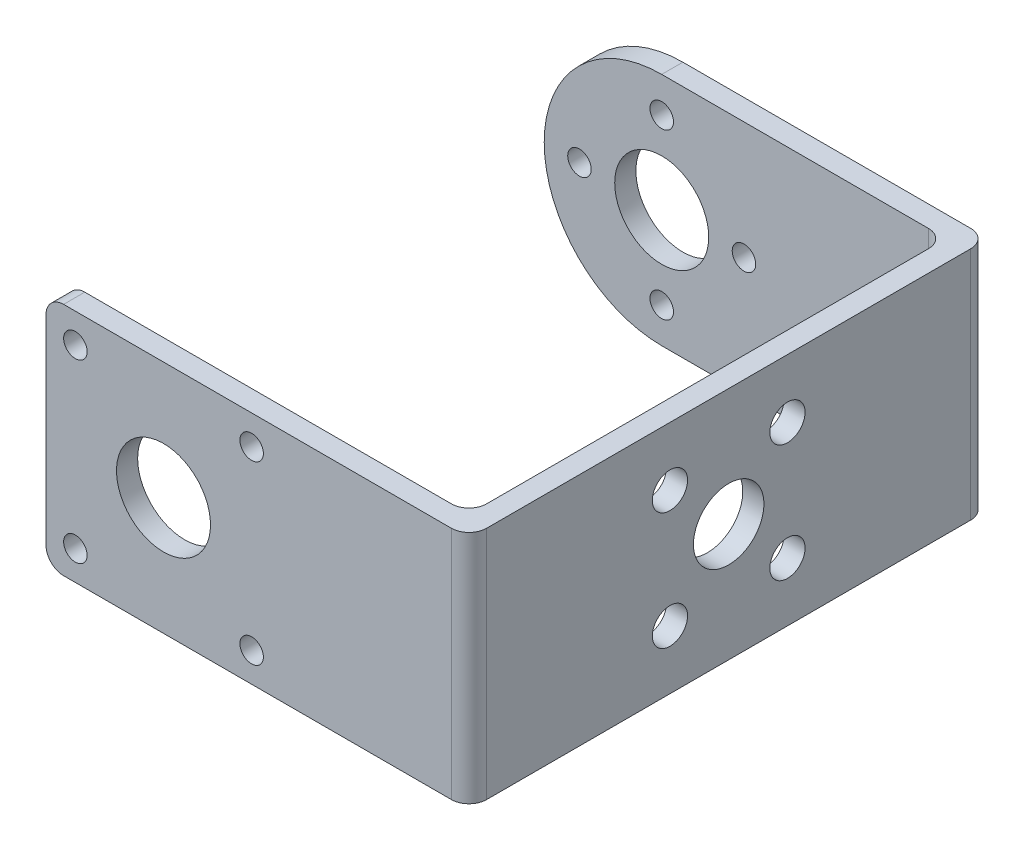
ISO-10303-21;
HEADER;
FILE_DESCRIPTION(('STEP AP214'),'2;1');
FILE_NAME('part.step','',(''),(''),'','','');
FILE_SCHEMA(('AUTOMOTIVE_DESIGN { 1 0 10303 214 1 1 1 1 }'));
ENDSEC;
DATA;
#1=APPLICATION_CONTEXT('core data for automotive mechanical design processes');
#2=APPLICATION_PROTOCOL_DEFINITION('international standard','automotive_design',2000,#1);
#3=PRODUCT_CONTEXT('',#1,'mechanical');
#4=PRODUCT('Part','Part','',(#3));
#5=PRODUCT_RELATED_PRODUCT_CATEGORY('part','',(#4));
#6=PRODUCT_DEFINITION_FORMATION('','',#4);
#7=PRODUCT_DEFINITION_CONTEXT('part definition',#1,'design');
#8=PRODUCT_DEFINITION('design','',#6,#7);
#9=PRODUCT_DEFINITION_SHAPE('','',#8);
#10=(LENGTH_UNIT() NAMED_UNIT(*) SI_UNIT(.MILLI.,.METRE.));
#11=(NAMED_UNIT(*) PLANE_ANGLE_UNIT() SI_UNIT($,.RADIAN.));
#12=(NAMED_UNIT(*) SI_UNIT($,.STERADIAN.) SOLID_ANGLE_UNIT());
#13=UNCERTAINTY_MEASURE_WITH_UNIT(LENGTH_MEASURE(1.E-05),#10,'distance_accuracy_value','');
#14=(GEOMETRIC_REPRESENTATION_CONTEXT(3) GLOBAL_UNCERTAINTY_ASSIGNED_CONTEXT((#13)) GLOBAL_UNIT_ASSIGNED_CONTEXT((#10,
#11,#12)) REPRESENTATION_CONTEXT('',''));
#15=CARTESIAN_POINT('',(0.,0.,0.));
#16=DIRECTION('',(0.,0.,1.));
#17=DIRECTION('',(1.,0.,0.));
#18=AXIS2_PLACEMENT_3D('',#15,#16,#17);
#19=CARTESIAN_POINT('',(-18.,10.,-20.3));
#20=DIRECTION('',(0.,0.,-1.));
#21=DIRECTION('',(-1.,0.,0.));
#22=AXIS2_PLACEMENT_3D('',#19,#20,#21);
#23=PLANE('',#22);
#24=CARTESIAN_POINT('',(-7.99999999999999,-7.,-20.3));
#25=DIRECTION('',(0.,0.,-1.));
#26=DIRECTION('',(-1.,0.,0.));
#27=AXIS2_PLACEMENT_3D('',#24,#25,#26);
#28=CIRCLE('',#27,1.);
#29=CARTESIAN_POINT('',(-8.99999999999999,-7.,-20.3));
#30=VERTEX_POINT('',#29);
#31=EDGE_CURVE('E422',#30,#30,#28,.T.);
#32=ORIENTED_EDGE('',*,*,#31,.T.);
#33=EDGE_LOOP('',(#32));
#34=FACE_BOUND('',#33,.T.);
#35=CARTESIAN_POINT('',(-15.,0.,-20.3));
#36=DIRECTION('',(0.,0.,-1.));
#37=DIRECTION('',(-1.,0.,0.));
#38=AXIS2_PLACEMENT_3D('',#35,#36,#37);
#39=CIRCLE('',#38,1.);
#40=CARTESIAN_POINT('',(-16.,0.,-20.3));
#41=VERTEX_POINT('',#40);
#42=EDGE_CURVE('E424',#41,#41,#39,.T.);
#43=ORIENTED_EDGE('',*,*,#42,.T.);
#44=EDGE_LOOP('',(#43));
#45=FACE_BOUND('',#44,.T.);
#46=CARTESIAN_POINT('',(-7.99999999999994,7.,-20.3));
#47=DIRECTION('',(0.,0.,-1.));
#48=DIRECTION('',(-1.,0.,0.));
#49=AXIS2_PLACEMENT_3D('',#46,#47,#48);
#50=CIRCLE('',#49,1.);
#51=CARTESIAN_POINT('',(-8.99999999999994,7.,-20.3));
#52=VERTEX_POINT('',#51);
#53=EDGE_CURVE('E430',#52,#52,#50,.T.);
#54=ORIENTED_EDGE('',*,*,#53,.T.);
#55=EDGE_LOOP('',(#54));
#56=FACE_BOUND('',#55,.T.);
#57=CARTESIAN_POINT('',(-0.999999999999994,0.,-20.3));
#58=DIRECTION('',(0.,0.,-1.));
#59=DIRECTION('',(-1.,0.,0.));
#60=AXIS2_PLACEMENT_3D('',#57,#58,#59);
#61=CIRCLE('',#60,1.);
#62=CARTESIAN_POINT('',(-1.99999999999999,0.,-20.3));
#63=VERTEX_POINT('',#62);
#64=EDGE_CURVE('E509',#63,#63,#61,.T.);
#65=ORIENTED_EDGE('',*,*,#64,.T.);
#66=EDGE_LOOP('',(#65));
#67=FACE_BOUND('',#66,.T.);
#68=CARTESIAN_POINT('',(-7.99999999999999,0.,-20.3));
#69=DIRECTION('',(0.,0.,-1.));
#70=DIRECTION('',(-1.,0.,0.));
#71=AXIS2_PLACEMENT_3D('',#68,#69,#70);
#72=CIRCLE('',#71,4.);
#73=CARTESIAN_POINT('',(-12.,0.,-20.3));
#74=VERTEX_POINT('',#73);
#75=EDGE_CURVE('E139',#74,#74,#72,.T.);
#76=ORIENTED_EDGE('',*,*,#75,.T.);
#77=EDGE_LOOP('',(#76));
#78=FACE_BOUND('',#77,.T.);
#79=CARTESIAN_POINT('',(-8.,0.,-20.3));
#80=DIRECTION('',(0.,0.,-1.));
#81=DIRECTION('',(-1.,0.,0.));
#82=AXIS2_PLACEMENT_3D('',#79,#80,#81);
#83=CIRCLE('',#82,10.);
#84=CARTESIAN_POINT('',(-8.,-10.,-20.3));
#85=VERTEX_POINT('',#84);
#86=CARTESIAN_POINT('',(-8.,10.,-20.3));
#87=VERTEX_POINT('',#86);
#88=EDGE_CURVE('E50',#85,#87,#83,.T.);
#89=ORIENTED_EDGE('',*,*,#88,.F.);
#90=DIRECTION('',(1.,0.,0.));
#91=VECTOR('',#90,1.);
#92=CARTESIAN_POINT('',(-18.,-10.,-20.3));
#93=LINE('',#92,#91);
#94=CARTESIAN_POINT('',(14.7,-10.,-20.3));
#95=VERTEX_POINT('',#94);
#96=EDGE_CURVE('E146',#85,#95,#93,.T.);
#97=ORIENTED_EDGE('',*,*,#96,.T.);
#98=DIRECTION('',(0.,-1.,0.));
#99=VECTOR('',#98,1.);
#100=CARTESIAN_POINT('',(14.7,10.,-20.3));
#101=LINE('',#100,#99);
#102=CARTESIAN_POINT('',(14.7,10.,-20.3));
#103=VERTEX_POINT('',#102);
#104=EDGE_CURVE('E208',#95,#103,#101,.F.);
#105=ORIENTED_EDGE('',*,*,#104,.T.);
#106=DIRECTION('',(1.,0.,0.));
#107=VECTOR('',#106,1.);
#108=CARTESIAN_POINT('',(-18.,10.,-20.3));
#109=LINE('',#108,#107);
#110=EDGE_CURVE('E150',#87,#103,#109,.T.);
#111=ORIENTED_EDGE('',*,*,#110,.F.);
#112=EDGE_LOOP('',(#89,#97,#105,#111));
#113=FACE_BOUND('',#112,.T.);
#114=ADVANCED_FACE('F33',(#34,#45,#56,#67,#78,#113),#23,.F.);
#115=CARTESIAN_POINT('',(-18.,10.,-22.1));
#116=DIRECTION('',(0.,0.,-1.));
#117=DIRECTION('',(-1.,0.,0.));
#118=AXIS2_PLACEMENT_3D('',#115,#116,#117);
#119=PLANE('',#118);
#120=CARTESIAN_POINT('',(-7.99999999999999,-7.,-22.1));
#121=DIRECTION('',(0.,0.,-1.));
#122=DIRECTION('',(-1.,0.,0.));
#123=AXIS2_PLACEMENT_3D('',#120,#121,#122);
#124=CIRCLE('',#123,1.);
#125=CARTESIAN_POINT('',(-8.99999999999999,-7.,-22.1));
#126=VERTEX_POINT('',#125);
#127=EDGE_CURVE('E420',#126,#126,#124,.T.);
#128=ORIENTED_EDGE('',*,*,#127,.F.);
#129=EDGE_LOOP('',(#128));
#130=FACE_BOUND('',#129,.T.);
#131=CARTESIAN_POINT('',(-15.,0.,-22.1));
#132=DIRECTION('',(0.,0.,-1.));
#133=DIRECTION('',(-1.,0.,0.));
#134=AXIS2_PLACEMENT_3D('',#131,#132,#133);
#135=CIRCLE('',#134,1.);
#136=CARTESIAN_POINT('',(-16.,0.,-22.1));
#137=VERTEX_POINT('',#136);
#138=EDGE_CURVE('E518',#137,#137,#135,.T.);
#139=ORIENTED_EDGE('',*,*,#138,.F.);
#140=EDGE_LOOP('',(#139));
#141=FACE_BOUND('',#140,.T.);
#142=CARTESIAN_POINT('',(-7.99999999999994,7.,-22.1));
#143=DIRECTION('',(0.,0.,-1.));
#144=DIRECTION('',(-1.,0.,0.));
#145=AXIS2_PLACEMENT_3D('',#142,#143,#144);
#146=CIRCLE('',#145,1.);
#147=CARTESIAN_POINT('',(-8.99999999999994,7.,-22.1));
#148=VERTEX_POINT('',#147);
#149=EDGE_CURVE('E515',#148,#148,#146,.T.);
#150=ORIENTED_EDGE('',*,*,#149,.F.);
#151=EDGE_LOOP('',(#150));
#152=FACE_BOUND('',#151,.T.);
#153=CARTESIAN_POINT('',(-0.999999999999994,0.,-22.1));
#154=DIRECTION('',(0.,0.,-1.));
#155=DIRECTION('',(-1.,0.,0.));
#156=AXIS2_PLACEMENT_3D('',#153,#154,#155);
#157=CIRCLE('',#156,1.);
#158=CARTESIAN_POINT('',(-1.99999999999999,0.,-22.1));
#159=VERTEX_POINT('',#158);
#160=EDGE_CURVE('E512',#159,#159,#157,.T.);
#161=ORIENTED_EDGE('',*,*,#160,.F.);
#162=EDGE_LOOP('',(#161));
#163=FACE_BOUND('',#162,.T.);
#164=CARTESIAN_POINT('',(-7.99999999999999,0.,-22.1));
#165=DIRECTION('',(0.,0.,1.));
#166=DIRECTION('',(1.,0.,0.));
#167=AXIS2_PLACEMENT_3D('',#164,#165,#166);
#168=CIRCLE('',#167,4.);
#169=CARTESIAN_POINT('',(-3.99999999999999,0.,-22.1));
#170=VERTEX_POINT('',#169);
#171=EDGE_CURVE('E238',#170,#170,#168,.T.);
#172=ORIENTED_EDGE('',*,*,#171,.T.);
#173=EDGE_LOOP('',(#172));
#174=FACE_BOUND('',#173,.T.);
#175=DIRECTION('',(1.,0.,0.));
#176=VECTOR('',#175,1.);
#177=CARTESIAN_POINT('',(-18.,-10.,-22.1));
#178=LINE('',#177,#176);
#179=CARTESIAN_POINT('',(-8.,-10.,-22.1));
#180=VERTEX_POINT('',#179);
#181=CARTESIAN_POINT('',(16.5,-10.,-22.1));
#182=VERTEX_POINT('',#181);
#183=EDGE_CURVE('E143',#180,#182,#178,.T.);
#184=ORIENTED_EDGE('',*,*,#183,.F.);
#185=CARTESIAN_POINT('',(-8.,0.,-22.1));
#186=DIRECTION('',(0.,0.,-1.));
#187=DIRECTION('',(-1.,0.,0.));
#188=AXIS2_PLACEMENT_3D('',#185,#186,#187);
#189=CIRCLE('',#188,10.);
#190=CARTESIAN_POINT('',(-8.,10.,-22.1));
#191=VERTEX_POINT('',#190);
#192=EDGE_CURVE('E135',#180,#191,#189,.T.);
#193=ORIENTED_EDGE('',*,*,#192,.T.);
#194=DIRECTION('',(1.,0.,0.));
#195=VECTOR('',#194,1.);
#196=CARTESIAN_POINT('',(-18.,10.,-22.1));
#197=LINE('',#196,#195);
#198=CARTESIAN_POINT('',(16.5,10.,-22.1));
#199=VERTEX_POINT('',#198);
#200=EDGE_CURVE('E58',#191,#199,#197,.T.);
#201=ORIENTED_EDGE('',*,*,#200,.T.);
#202=DIRECTION('',(0.,-1.,0.));
#203=VECTOR('',#202,1.);
#204=CARTESIAN_POINT('',(16.5,-10.,-22.1));
#205=LINE('',#204,#203);
#206=EDGE_CURVE('E149',#199,#182,#205,.T.);
#207=ORIENTED_EDGE('',*,*,#206,.T.);
#208=EDGE_LOOP('',(#184,#193,#201,#207));
#209=FACE_BOUND('',#208,.T.);
#210=ADVANCED_FACE('F147',(#130,#141,#152,#163,#174,#209),#119,.T.);
#211=CARTESIAN_POINT('',(16.2,10.,20.3));
#212=DIRECTION('',(-1.,0.,0.));
#213=DIRECTION('',(0.,0.,1.));
#214=AXIS2_PLACEMENT_3D('',#211,#212,#213);
#215=PLANE('',#214);
#216=CARTESIAN_POINT('',(16.2,4.99999999999995,5.00000000000005));
#217=DIRECTION('',(-1.,0.,0.));
#218=DIRECTION('',(0.,0.,1.));
#219=AXIS2_PLACEMENT_3D('',#216,#217,#218);
#220=CIRCLE('',#219,1.5);
#221=CARTESIAN_POINT('',(16.2,4.99999999999995,6.50000000000005));
#222=VERTEX_POINT('',#221);
#223=EDGE_CURVE('E454',#222,#222,#220,.T.);
#224=ORIENTED_EDGE('',*,*,#223,.F.);
#225=EDGE_LOOP('',(#224));
#226=FACE_BOUND('',#225,.T.);
#227=CARTESIAN_POINT('',(16.2,5.00000000000003,-4.99999999999996));
#228=DIRECTION('',(-1.,0.,0.));
#229=DIRECTION('',(0.,0.,1.));
#230=AXIS2_PLACEMENT_3D('',#227,#228,#229);
#231=CIRCLE('',#230,1.5);
#232=CARTESIAN_POINT('',(16.2,5.00000000000003,-3.49999999999996));
#233=VERTEX_POINT('',#232);
#234=EDGE_CURVE('E461',#233,#233,#231,.T.);
#235=ORIENTED_EDGE('',*,*,#234,.F.);
#236=EDGE_LOOP('',(#235));
#237=FACE_BOUND('',#236,.T.);
#238=CARTESIAN_POINT('',(16.2,-4.99999999999998,-5.00000000000002));
#239=DIRECTION('',(-1.,0.,0.));
#240=DIRECTION('',(0.,0.,1.));
#241=AXIS2_PLACEMENT_3D('',#238,#239,#240);
#242=CIRCLE('',#241,1.5);
#243=CARTESIAN_POINT('',(16.2,-4.99999999999998,-3.50000000000002));
#244=VERTEX_POINT('',#243);
#245=EDGE_CURVE('E458',#244,#244,#242,.T.);
#246=ORIENTED_EDGE('',*,*,#245,.F.);
#247=EDGE_LOOP('',(#246));
#248=FACE_BOUND('',#247,.T.);
#249=CARTESIAN_POINT('',(16.2,-5.,5.));
#250=DIRECTION('',(-1.,0.,0.));
#251=DIRECTION('',(0.,0.,1.));
#252=AXIS2_PLACEMENT_3D('',#249,#250,#251);
#253=CIRCLE('',#252,1.5);
#254=CARTESIAN_POINT('',(16.2,-5.,6.5));
#255=VERTEX_POINT('',#254);
#256=EDGE_CURVE('E455',#255,#255,#253,.T.);
#257=ORIENTED_EDGE('',*,*,#256,.F.);
#258=EDGE_LOOP('',(#257));
#259=FACE_BOUND('',#258,.T.);
#260=CARTESIAN_POINT('',(16.2,0.,0.));
#261=DIRECTION('',(-1.,0.,0.));
#262=DIRECTION('',(0.,0.,1.));
#263=AXIS2_PLACEMENT_3D('',#260,#261,#262);
#264=CIRCLE('',#263,3.);
#265=CARTESIAN_POINT('',(16.2,0.,3.));
#266=VERTEX_POINT('',#265);
#267=EDGE_CURVE('E224',#266,#266,#264,.T.);
#268=ORIENTED_EDGE('',*,*,#267,.F.);
#269=EDGE_LOOP('',(#268));
#270=FACE_BOUND('',#269,.T.);
#271=DIRECTION('',(0.,0.,-1.));
#272=VECTOR('',#271,1.);
#273=CARTESIAN_POINT('',(16.2,-10.,20.3));
#274=LINE('',#273,#272);
#275=CARTESIAN_POINT('',(16.2,-10.,18.8));
#276=VERTEX_POINT('',#275);
#277=CARTESIAN_POINT('',(16.2,-10.,-18.8));
#278=VERTEX_POINT('',#277);
#279=EDGE_CURVE('E265',#276,#278,#274,.T.);
#280=ORIENTED_EDGE('',*,*,#279,.F.);
#281=DIRECTION('',(0.,-1.,0.));
#282=VECTOR('',#281,1.);
#283=CARTESIAN_POINT('',(16.2,10.,18.8));
#284=LINE('',#283,#282);
#285=CARTESIAN_POINT('',(16.2,10.,18.8));
#286=VERTEX_POINT('',#285);
#287=EDGE_CURVE('E206',#276,#286,#284,.F.);
#288=ORIENTED_EDGE('',*,*,#287,.T.);
#289=DIRECTION('',(0.,0.,-1.));
#290=VECTOR('',#289,1.);
#291=CARTESIAN_POINT('',(16.2,10.,20.3));
#292=LINE('',#291,#290);
#293=CARTESIAN_POINT('',(16.2,10.,-18.8));
#294=VERTEX_POINT('',#293);
#295=EDGE_CURVE('E153',#286,#294,#292,.T.);
#296=ORIENTED_EDGE('',*,*,#295,.T.);
#297=DIRECTION('',(0.,-1.,0.));
#298=VECTOR('',#297,1.);
#299=CARTESIAN_POINT('',(16.2,10.,-18.8));
#300=LINE('',#299,#298);
#301=EDGE_CURVE('E203',#294,#278,#300,.T.);
#302=ORIENTED_EDGE('',*,*,#301,.T.);
#303=EDGE_LOOP('',(#280,#288,#296,#302));
#304=FACE_BOUND('',#303,.T.);
#305=ADVANCED_FACE('F301',(#226,#237,#248,#259,#270,#304),#215,.T.);
#306=CARTESIAN_POINT('',(-18.,10.,20.3));
#307=DIRECTION('',(0.,0.,-1.));
#308=DIRECTION('',(-1.,0.,0.));
#309=AXIS2_PLACEMENT_3D('',#306,#307,#308);
#310=PLANE('',#309);
#311=CARTESIAN_POINT('',(-0.50000000000007,-7.50000000000008,20.3));
#312=DIRECTION('',(0.,0.,-1.));
#313=DIRECTION('',(-1.,0.,0.));
#314=AXIS2_PLACEMENT_3D('',#311,#312,#313);
#315=CIRCLE('',#314,1.);
#316=CARTESIAN_POINT('',(-1.50000000000007,-7.50000000000008,20.3));
#317=VERTEX_POINT('',#316);
#318=EDGE_CURVE('E451',#317,#317,#315,.T.);
#319=ORIENTED_EDGE('',*,*,#318,.F.);
#320=EDGE_LOOP('',(#319));
#321=FACE_BOUND('',#320,.T.);
#322=CARTESIAN_POINT('',(-0.499999999999937,7.49999999999994,20.3));
#323=DIRECTION('',(0.,0.,-1.));
#324=DIRECTION('',(-1.,0.,0.));
#325=AXIS2_PLACEMENT_3D('',#322,#323,#324);
#326=CIRCLE('',#325,1.);
#327=CARTESIAN_POINT('',(-1.49999999999994,7.49999999999994,20.3));
#328=VERTEX_POINT('',#327);
#329=EDGE_CURVE('E448',#328,#328,#326,.T.);
#330=ORIENTED_EDGE('',*,*,#329,.F.);
#331=EDGE_LOOP('',(#330));
#332=FACE_BOUND('',#331,.T.);
#333=CARTESIAN_POINT('',(-15.5,7.50000000000003,20.3));
#334=DIRECTION('',(0.,0.,-1.));
#335=DIRECTION('',(-1.,0.,0.));
#336=AXIS2_PLACEMENT_3D('',#333,#334,#335);
#337=CIRCLE('',#336,1.);
#338=CARTESIAN_POINT('',(-16.5,7.50000000000003,20.3));
#339=VERTEX_POINT('',#338);
#340=EDGE_CURVE('E445',#339,#339,#337,.T.);
#341=ORIENTED_EDGE('',*,*,#340,.F.);
#342=EDGE_LOOP('',(#341));
#343=FACE_BOUND('',#342,.T.);
#344=CARTESIAN_POINT('',(-15.5,-7.5,20.3));
#345=DIRECTION('',(0.,0.,-1.));
#346=DIRECTION('',(-1.,0.,0.));
#347=AXIS2_PLACEMENT_3D('',#344,#345,#346);
#348=CIRCLE('',#347,1.);
#349=CARTESIAN_POINT('',(-16.5,-7.5,20.3));
#350=VERTEX_POINT('',#349);
#351=EDGE_CURVE('E442',#350,#350,#348,.T.);
#352=ORIENTED_EDGE('',*,*,#351,.F.);
#353=EDGE_LOOP('',(#352));
#354=FACE_BOUND('',#353,.T.);
#355=CARTESIAN_POINT('',(-7.99999999999999,0.,20.3));
#356=DIRECTION('',(0.,0.,-1.));
#357=DIRECTION('',(-1.,0.,0.));
#358=AXIS2_PLACEMENT_3D('',#355,#356,#357);
#359=CIRCLE('',#358,4.);
#360=CARTESIAN_POINT('',(-12.,0.,20.3));
#361=VERTEX_POINT('',#360);
#362=EDGE_CURVE('E243',#361,#361,#359,.T.);
#363=ORIENTED_EDGE('',*,*,#362,.F.);
#364=EDGE_LOOP('',(#363));
#365=FACE_BOUND('',#364,.T.);
#366=DIRECTION('',(1.,0.,0.));
#367=VECTOR('',#366,1.);
#368=CARTESIAN_POINT('',(-18.,-10.,20.3));
#369=LINE('',#368,#367);
#370=CARTESIAN_POINT('',(-16.5,-10.,20.3));
#371=VERTEX_POINT('',#370);
#372=CARTESIAN_POINT('',(14.7,-10.,20.3));
#373=VERTEX_POINT('',#372);
#374=EDGE_CURVE('E268',#371,#373,#369,.T.);
#375=ORIENTED_EDGE('',*,*,#374,.F.);
#376=CARTESIAN_POINT('',(-16.5,-8.5,20.3));
#377=DIRECTION('',(0.,0.,-1.));
#378=DIRECTION('',(-1.,0.,0.));
#379=AXIS2_PLACEMENT_3D('',#376,#377,#378);
#380=CIRCLE('',#379,1.5);
#381=CARTESIAN_POINT('',(-18.,-8.5,20.3));
#382=VERTEX_POINT('',#381);
#383=EDGE_CURVE('E188',#371,#382,#380,.T.);
#384=ORIENTED_EDGE('',*,*,#383,.T.);
#385=DIRECTION('',(0.,-1.,0.));
#386=VECTOR('',#385,1.);
#387=CARTESIAN_POINT('',(-18.,10.,20.3));
#388=LINE('',#387,#386);
#389=CARTESIAN_POINT('',(-18.,8.5,20.3));
#390=VERTEX_POINT('',#389);
#391=EDGE_CURVE('E163',#390,#382,#388,.T.);
#392=ORIENTED_EDGE('',*,*,#391,.F.);
#393=CARTESIAN_POINT('',(-16.5,8.5,20.3));
#394=DIRECTION('',(0.,0.,-1.));
#395=DIRECTION('',(-1.,0.,0.));
#396=AXIS2_PLACEMENT_3D('',#393,#394,#395);
#397=CIRCLE('',#396,1.5);
#398=CARTESIAN_POINT('',(-16.5,10.,20.3));
#399=VERTEX_POINT('',#398);
#400=EDGE_CURVE('E186',#390,#399,#397,.T.);
#401=ORIENTED_EDGE('',*,*,#400,.T.);
#402=DIRECTION('',(1.,0.,0.));
#403=VECTOR('',#402,1.);
#404=CARTESIAN_POINT('',(-18.,10.,20.3));
#405=LINE('',#404,#403);
#406=CARTESIAN_POINT('',(14.7,10.,20.3));
#407=VERTEX_POINT('',#406);
#408=EDGE_CURVE('E254',#399,#407,#405,.T.);
#409=ORIENTED_EDGE('',*,*,#408,.T.);
#410=DIRECTION('',(0.,-1.,0.));
#411=VECTOR('',#410,1.);
#412=CARTESIAN_POINT('',(14.7,-10.,20.3));
#413=LINE('',#412,#411);
#414=EDGE_CURVE('E183',#407,#373,#413,.T.);
#415=ORIENTED_EDGE('',*,*,#414,.T.);
#416=EDGE_LOOP('',(#375,#384,#392,#401,#409,#415));
#417=FACE_BOUND('',#416,.T.);
#418=ADVANCED_FACE('F310',(#321,#332,#343,#354,#365,#417),#310,.T.);
#419=CARTESIAN_POINT('',(-18.,10.,20.3));
#420=DIRECTION('',(1.,0.,0.));
#421=DIRECTION('',(0.,0.,-1.));
#422=AXIS2_PLACEMENT_3D('',#419,#420,#421);
#423=PLANE('',#422);
#424=ORIENTED_EDGE('',*,*,#391,.T.);
#425=DIRECTION('',(0.,0.,1.));
#426=VECTOR('',#425,1.);
#427=CARTESIAN_POINT('',(-18.,-8.5,20.3));
#428=LINE('',#427,#426);
#429=CARTESIAN_POINT('',(-18.,-8.5,22.1));
#430=VERTEX_POINT('',#429);
#431=EDGE_CURVE('E168',#382,#430,#428,.T.);
#432=ORIENTED_EDGE('',*,*,#431,.T.);
#433=DIRECTION('',(0.,-1.,0.));
#434=VECTOR('',#433,1.);
#435=CARTESIAN_POINT('',(-18.,10.,22.1));
#436=LINE('',#435,#434);
#437=CARTESIAN_POINT('',(-18.,8.5,22.1));
#438=VERTEX_POINT('',#437);
#439=EDGE_CURVE('E160',#438,#430,#436,.T.);
#440=ORIENTED_EDGE('',*,*,#439,.F.);
#441=DIRECTION('',(0.,0.,1.));
#442=VECTOR('',#441,1.);
#443=CARTESIAN_POINT('',(-18.,8.5,20.3));
#444=LINE('',#443,#442);
#445=EDGE_CURVE('E166',#438,#390,#444,.F.);
#446=ORIENTED_EDGE('',*,*,#445,.T.);
#447=EDGE_LOOP('',(#424,#432,#440,#446));
#448=FACE_BOUND('',#447,.T.);
#449=ADVANCED_FACE('F318',(#448),#423,.F.);
#450=CARTESIAN_POINT('',(-18.,10.,22.1));
#451=DIRECTION('',(0.,0.,-1.));
#452=DIRECTION('',(-1.,0.,0.));
#453=AXIS2_PLACEMENT_3D('',#450,#451,#452);
#454=PLANE('',#453);
#455=CARTESIAN_POINT('',(-0.50000000000007,-7.50000000000008,22.1));
#456=DIRECTION('',(0.,0.,1.));
#457=DIRECTION('',(1.,0.,0.));
#458=AXIS2_PLACEMENT_3D('',#455,#456,#457);
#459=CIRCLE('',#458,1.);
#460=CARTESIAN_POINT('',(0.49999999999993,-7.50000000000008,22.1));
#461=VERTEX_POINT('',#460);
#462=EDGE_CURVE('E423',#461,#461,#459,.T.);
#463=ORIENTED_EDGE('',*,*,#462,.F.);
#464=EDGE_LOOP('',(#463));
#465=FACE_BOUND('',#464,.T.);
#466=CARTESIAN_POINT('',(-0.499999999999937,7.49999999999994,22.1));
#467=DIRECTION('',(0.,0.,1.));
#468=DIRECTION('',(1.,0.,0.));
#469=AXIS2_PLACEMENT_3D('',#466,#467,#468);
#470=CIRCLE('',#469,1.);
#471=CARTESIAN_POINT('',(0.500000000000064,7.49999999999994,22.1));
#472=VERTEX_POINT('',#471);
#473=EDGE_CURVE('E427',#472,#472,#470,.T.);
#474=ORIENTED_EDGE('',*,*,#473,.F.);
#475=EDGE_LOOP('',(#474));
#476=FACE_BOUND('',#475,.T.);
#477=CARTESIAN_POINT('',(-15.5,7.50000000000003,22.1));
#478=DIRECTION('',(0.,0.,1.));
#479=DIRECTION('',(1.,0.,0.));
#480=AXIS2_PLACEMENT_3D('',#477,#478,#479);
#481=CIRCLE('',#480,1.);
#482=CARTESIAN_POINT('',(-14.5,7.50000000000003,22.1));
#483=VERTEX_POINT('',#482);
#484=EDGE_CURVE('E434',#483,#483,#481,.T.);
#485=ORIENTED_EDGE('',*,*,#484,.F.);
#486=EDGE_LOOP('',(#485));
#487=FACE_BOUND('',#486,.T.);
#488=CARTESIAN_POINT('',(-15.5,-7.5,22.1));
#489=DIRECTION('',(0.,0.,1.));
#490=DIRECTION('',(1.,0.,0.));
#491=AXIS2_PLACEMENT_3D('',#488,#489,#490);
#492=CIRCLE('',#491,1.);
#493=CARTESIAN_POINT('',(-14.5,-7.5,22.1));
#494=VERTEX_POINT('',#493);
#495=EDGE_CURVE('E437',#494,#494,#492,.T.);
#496=ORIENTED_EDGE('',*,*,#495,.F.);
#497=EDGE_LOOP('',(#496));
#498=FACE_BOUND('',#497,.T.);
#499=CARTESIAN_POINT('',(-7.99999999999999,0.,22.1));
#500=DIRECTION('',(0.,0.,1.));
#501=DIRECTION('',(1.,0.,0.));
#502=AXIS2_PLACEMENT_3D('',#499,#500,#501);
#503=CIRCLE('',#502,4.);
#504=CARTESIAN_POINT('',(-3.99999999999999,0.,22.1));
#505=VERTEX_POINT('',#504);
#506=EDGE_CURVE('E234',#505,#505,#503,.T.);
#507=ORIENTED_EDGE('',*,*,#506,.F.);
#508=EDGE_LOOP('',(#507));
#509=FACE_BOUND('',#508,.T.);
#510=ORIENTED_EDGE('',*,*,#439,.T.);
#511=CARTESIAN_POINT('',(-16.5,-8.5,22.1));
#512=DIRECTION('',(0.,0.,-1.));
#513=DIRECTION('',(-1.,0.,0.));
#514=AXIS2_PLACEMENT_3D('',#511,#512,#513);
#515=CIRCLE('',#514,1.5);
#516=CARTESIAN_POINT('',(-16.5,-10.,22.1));
#517=VERTEX_POINT('',#516);
#518=EDGE_CURVE('E175',#430,#517,#515,.F.);
#519=ORIENTED_EDGE('',*,*,#518,.T.);
#520=DIRECTION('',(1.,0.,0.));
#521=VECTOR('',#520,1.);
#522=CARTESIAN_POINT('',(-18.,-10.,22.1));
#523=LINE('',#522,#521);
#524=CARTESIAN_POINT('',(16.5,-10.,22.1));
#525=VERTEX_POINT('',#524);
#526=EDGE_CURVE('E156',#517,#525,#523,.T.);
#527=ORIENTED_EDGE('',*,*,#526,.T.);
#528=DIRECTION('',(0.,-1.,0.));
#529=VECTOR('',#528,1.);
#530=CARTESIAN_POINT('',(16.5,10.,22.1));
#531=LINE('',#530,#529);
#532=CARTESIAN_POINT('',(16.5,10.,22.1));
#533=VERTEX_POINT('',#532);
#534=EDGE_CURVE('E171',#525,#533,#531,.F.);
#535=ORIENTED_EDGE('',*,*,#534,.T.);
#536=DIRECTION('',(1.,0.,0.));
#537=VECTOR('',#536,1.);
#538=CARTESIAN_POINT('',(-18.,10.,22.1));
#539=LINE('',#538,#537);
#540=CARTESIAN_POINT('',(-16.5,10.,22.1));
#541=VERTEX_POINT('',#540);
#542=EDGE_CURVE('E257',#541,#533,#539,.T.);
#543=ORIENTED_EDGE('',*,*,#542,.F.);
#544=CARTESIAN_POINT('',(-16.5,8.5,22.1));
#545=DIRECTION('',(0.,0.,-1.));
#546=DIRECTION('',(-1.,0.,0.));
#547=AXIS2_PLACEMENT_3D('',#544,#545,#546);
#548=CIRCLE('',#547,1.5);
#549=EDGE_CURVE('E173',#541,#438,#548,.F.);
#550=ORIENTED_EDGE('',*,*,#549,.T.);
#551=EDGE_LOOP('',(#510,#519,#527,#535,#543,#550));
#552=FACE_BOUND('',#551,.T.);
#553=ADVANCED_FACE('F274',(#465,#476,#487,#498,#509,#552),#454,.F.);
#554=CARTESIAN_POINT('',(18.,10.,22.1));
#555=DIRECTION('',(-1.,0.,0.));
#556=DIRECTION('',(0.,0.,1.));
#557=AXIS2_PLACEMENT_3D('',#554,#555,#556);
#558=PLANE('',#557);
#559=CARTESIAN_POINT('',(18.,4.99999999999995,5.00000000000005));
#560=DIRECTION('',(-1.,0.,0.));
#561=DIRECTION('',(0.,0.,1.));
#562=AXIS2_PLACEMENT_3D('',#559,#560,#561);
#563=CIRCLE('',#562,1.5);
#564=CARTESIAN_POINT('',(18.,4.99999999999995,6.50000000000005));
#565=VERTEX_POINT('',#564);
#566=EDGE_CURVE('E37',#565,#565,#563,.T.);
#567=ORIENTED_EDGE('',*,*,#566,.T.);
#568=EDGE_LOOP('',(#567));
#569=FACE_BOUND('',#568,.T.);
#570=CARTESIAN_POINT('',(18.,5.00000000000003,-4.99999999999996));
#571=DIRECTION('',(-1.,0.,0.));
#572=DIRECTION('',(0.,0.,1.));
#573=AXIS2_PLACEMENT_3D('',#570,#571,#572);
#574=CIRCLE('',#573,1.5);
#575=CARTESIAN_POINT('',(18.,5.00000000000003,-3.49999999999996));
#576=VERTEX_POINT('',#575);
#577=EDGE_CURVE('E229',#576,#576,#574,.T.);
#578=ORIENTED_EDGE('',*,*,#577,.T.);
#579=EDGE_LOOP('',(#578));
#580=FACE_BOUND('',#579,.T.);
#581=CARTESIAN_POINT('',(18.,-4.99999999999998,-5.00000000000002));
#582=DIRECTION('',(-1.,0.,0.));
#583=DIRECTION('',(0.,0.,1.));
#584=AXIS2_PLACEMENT_3D('',#581,#582,#583);
#585=CIRCLE('',#584,1.5);
#586=CARTESIAN_POINT('',(18.,-4.99999999999998,-3.50000000000002));
#587=VERTEX_POINT('',#586);
#588=EDGE_CURVE('E227',#587,#587,#585,.T.);
#589=ORIENTED_EDGE('',*,*,#588,.T.);
#590=EDGE_LOOP('',(#589));
#591=FACE_BOUND('',#590,.T.);
#592=CARTESIAN_POINT('',(18.,-5.,5.));
#593=DIRECTION('',(-1.,0.,0.));
#594=DIRECTION('',(0.,0.,1.));
#595=AXIS2_PLACEMENT_3D('',#592,#593,#594);
#596=CIRCLE('',#595,1.5);
#597=CARTESIAN_POINT('',(18.,-5.,6.5));
#598=VERTEX_POINT('',#597);
#599=EDGE_CURVE('E223',#598,#598,#596,.T.);
#600=ORIENTED_EDGE('',*,*,#599,.T.);
#601=EDGE_LOOP('',(#600));
#602=FACE_BOUND('',#601,.T.);
#603=CARTESIAN_POINT('',(18.,0.,0.));
#604=DIRECTION('',(-1.,0.,0.));
#605=DIRECTION('',(0.,0.,1.));
#606=AXIS2_PLACEMENT_3D('',#603,#604,#605);
#607=CIRCLE('',#606,3.);
#608=CARTESIAN_POINT('',(18.,0.,3.));
#609=VERTEX_POINT('',#608);
#610=EDGE_CURVE('E220',#609,#609,#607,.T.);
#611=ORIENTED_EDGE('',*,*,#610,.T.);
#612=EDGE_LOOP('',(#611));
#613=FACE_BOUND('',#612,.T.);
#614=DIRECTION('',(0.,0.,-1.));
#615=VECTOR('',#614,1.);
#616=CARTESIAN_POINT('',(18.,10.,22.1));
#617=LINE('',#616,#615);
#618=CARTESIAN_POINT('',(18.,10.,20.6));
#619=VERTEX_POINT('',#618);
#620=CARTESIAN_POINT('',(18.,10.,-20.6));
#621=VERTEX_POINT('',#620);
#622=EDGE_CURVE('E260',#619,#621,#617,.T.);
#623=ORIENTED_EDGE('',*,*,#622,.F.);
#624=DIRECTION('',(0.,-1.,0.));
#625=VECTOR('',#624,1.);
#626=CARTESIAN_POINT('',(18.,10.,20.6));
#627=LINE('',#626,#625);
#628=CARTESIAN_POINT('',(18.,-10.,20.6));
#629=VERTEX_POINT('',#628);
#630=EDGE_CURVE('E199',#619,#629,#627,.T.);
#631=ORIENTED_EDGE('',*,*,#630,.T.);
#632=DIRECTION('',(0.,0.,-1.));
#633=VECTOR('',#632,1.);
#634=CARTESIAN_POINT('',(18.,-10.,22.1));
#635=LINE('',#634,#633);
#636=CARTESIAN_POINT('',(18.,-10.,-20.6));
#637=VERTEX_POINT('',#636);
#638=EDGE_CURVE('E151',#629,#637,#635,.T.);
#639=ORIENTED_EDGE('',*,*,#638,.T.);
#640=DIRECTION('',(0.,-1.,0.));
#641=VECTOR('',#640,1.);
#642=CARTESIAN_POINT('',(18.,10.,-20.6));
#643=LINE('',#642,#641);
#644=EDGE_CURVE('E197',#637,#621,#643,.F.);
#645=ORIENTED_EDGE('',*,*,#644,.T.);
#646=EDGE_LOOP('',(#623,#631,#639,#645));
#647=FACE_BOUND('',#646,.T.);
#648=ADVANCED_FACE('F286',(#569,#580,#591,#602,#613,#647),#558,.F.);
#649=CARTESIAN_POINT('',(0.,10.,0.));
#650=DIRECTION('',(0.,1.,0.));
#651=DIRECTION('',(0.,0.,1.));
#652=AXIS2_PLACEMENT_3D('',#649,#650,#651);
#653=PLANE('',#652);
#654=DIRECTION('',(0.,0.,-1.));
#655=VECTOR('',#654,1.);
#656=CARTESIAN_POINT('',(-8.,10.,-20.1));
#657=LINE('',#656,#655);
#658=EDGE_CURVE('E42',#87,#191,#657,.T.);
#659=ORIENTED_EDGE('',*,*,#658,.F.);
#660=ORIENTED_EDGE('',*,*,#110,.T.);
#661=CARTESIAN_POINT('',(14.7,10.,-18.8));
#662=DIRECTION('',(0.,1.,0.));
#663=DIRECTION('',(0.,0.,1.));
#664=AXIS2_PLACEMENT_3D('',#661,#662,#663);
#665=CIRCLE('',#664,1.5);
#666=EDGE_CURVE('E217',#103,#294,#665,.F.);
#667=ORIENTED_EDGE('',*,*,#666,.T.);
#668=ORIENTED_EDGE('',*,*,#295,.F.);
#669=CARTESIAN_POINT('',(14.7,10.,18.8));
#670=DIRECTION('',(0.,1.,0.));
#671=DIRECTION('',(0.,0.,1.));
#672=AXIS2_PLACEMENT_3D('',#669,#670,#671);
#673=CIRCLE('',#672,1.5);
#674=EDGE_CURVE('E213',#286,#407,#673,.F.);
#675=ORIENTED_EDGE('',*,*,#674,.T.);
#676=ORIENTED_EDGE('',*,*,#408,.F.);
#677=DIRECTION('',(0.,0.,1.));
#678=VECTOR('',#677,1.);
#679=CARTESIAN_POINT('',(-16.5,10.,22.1));
#680=LINE('',#679,#678);
#681=EDGE_CURVE('E194',#399,#541,#680,.T.);
#682=ORIENTED_EDGE('',*,*,#681,.T.);
#683=ORIENTED_EDGE('',*,*,#542,.T.);
#684=CARTESIAN_POINT('',(16.5,10.,20.6));
#685=DIRECTION('',(0.,1.,0.));
#686=DIRECTION('',(0.,0.,1.));
#687=AXIS2_PLACEMENT_3D('',#684,#685,#686);
#688=CIRCLE('',#687,1.5);
#689=EDGE_CURVE('E192',#533,#619,#688,.T.);
#690=ORIENTED_EDGE('',*,*,#689,.T.);
#691=ORIENTED_EDGE('',*,*,#622,.T.);
#692=CARTESIAN_POINT('',(16.5,10.,-20.6));
#693=DIRECTION('',(0.,1.,0.));
#694=DIRECTION('',(0.,0.,1.));
#695=AXIS2_PLACEMENT_3D('',#692,#693,#694);
#696=CIRCLE('',#695,1.5);
#697=EDGE_CURVE('E190',#621,#199,#696,.T.);
#698=ORIENTED_EDGE('',*,*,#697,.T.);
#699=ORIENTED_EDGE('',*,*,#200,.F.);
#700=EDGE_LOOP('',(#659,#660,#667,#668,#675,#676,#682,#683,#690,#691,#698,#699));
#701=FACE_BOUND('',#700,.T.);
#702=ADVANCED_FACE('F283',(#701),#653,.T.);
#703=CARTESIAN_POINT('',(0.,-10.,0.));
#704=DIRECTION('',(0.,1.,0.));
#705=DIRECTION('',(0.,0.,1.));
#706=AXIS2_PLACEMENT_3D('',#703,#704,#705);
#707=PLANE('',#706);
#708=ORIENTED_EDGE('',*,*,#96,.F.);
#709=DIRECTION('',(0.,0.,-1.));
#710=VECTOR('',#709,1.);
#711=CARTESIAN_POINT('',(-8.,-10.,-20.1));
#712=LINE('',#711,#710);
#713=EDGE_CURVE('E12',#85,#180,#712,.T.);
#714=ORIENTED_EDGE('',*,*,#713,.T.);
#715=ORIENTED_EDGE('',*,*,#183,.T.);
#716=CARTESIAN_POINT('',(16.5,-10.,-20.6));
#717=DIRECTION('',(0.,1.,0.));
#718=DIRECTION('',(0.,0.,1.));
#719=AXIS2_PLACEMENT_3D('',#716,#717,#718);
#720=CIRCLE('',#719,1.5);
#721=EDGE_CURVE('E177',#182,#637,#720,.F.);
#722=ORIENTED_EDGE('',*,*,#721,.T.);
#723=ORIENTED_EDGE('',*,*,#638,.F.);
#724=CARTESIAN_POINT('',(16.5,-10.,20.6));
#725=DIRECTION('',(0.,1.,0.));
#726=DIRECTION('',(0.,0.,1.));
#727=AXIS2_PLACEMENT_3D('',#724,#725,#726);
#728=CIRCLE('',#727,1.5);
#729=EDGE_CURVE('E179',#629,#525,#728,.F.);
#730=ORIENTED_EDGE('',*,*,#729,.T.);
#731=ORIENTED_EDGE('',*,*,#526,.F.);
#732=DIRECTION('',(0.,0.,1.));
#733=VECTOR('',#732,1.);
#734=CARTESIAN_POINT('',(-16.5,-10.,0.));
#735=LINE('',#734,#733);
#736=EDGE_CURVE('E181',#517,#371,#735,.F.);
#737=ORIENTED_EDGE('',*,*,#736,.T.);
#738=ORIENTED_EDGE('',*,*,#374,.T.);
#739=CARTESIAN_POINT('',(14.7,-10.,18.8));
#740=DIRECTION('',(0.,1.,0.));
#741=DIRECTION('',(0.,0.,1.));
#742=AXIS2_PLACEMENT_3D('',#739,#740,#741);
#743=CIRCLE('',#742,1.5);
#744=EDGE_CURVE('E211',#373,#276,#743,.T.);
#745=ORIENTED_EDGE('',*,*,#744,.T.);
#746=ORIENTED_EDGE('',*,*,#279,.T.);
#747=CARTESIAN_POINT('',(14.7,-10.,-18.8));
#748=DIRECTION('',(0.,1.,0.));
#749=DIRECTION('',(0.,0.,1.));
#750=AXIS2_PLACEMENT_3D('',#747,#748,#749);
#751=CIRCLE('',#750,1.5);
#752=EDGE_CURVE('E215',#278,#95,#751,.T.);
#753=ORIENTED_EDGE('',*,*,#752,.T.);
#754=EDGE_LOOP('',(#708,#714,#715,#722,#723,#730,#731,#737,#738,#745,#746,#753));
#755=FACE_BOUND('',#754,.T.);
#756=ADVANCED_FACE('F142',(#755),#707,.F.);
#757=CARTESIAN_POINT('',(-16.5,-8.5,20.3));
#758=DIRECTION('',(0.,0.,1.));
#759=DIRECTION('',(1.,0.,0.));
#760=AXIS2_PLACEMENT_3D('',#757,#758,#759);
#761=CYLINDRICAL_SURFACE('',#760,1.5);
#762=ORIENTED_EDGE('',*,*,#383,.F.);
#763=ORIENTED_EDGE('',*,*,#736,.F.);
#764=ORIENTED_EDGE('',*,*,#518,.F.);
#765=ORIENTED_EDGE('',*,*,#431,.F.);
#766=EDGE_LOOP('',(#762,#763,#764,#765));
#767=FACE_BOUND('',#766,.T.);
#768=ADVANCED_FACE('F322',(#767),#761,.T.);
#769=CARTESIAN_POINT('',(-16.5,8.5,0.));
#770=DIRECTION('',(0.,0.,-1.));
#771=DIRECTION('',(-1.,0.,0.));
#772=AXIS2_PLACEMENT_3D('',#769,#770,#771);
#773=CYLINDRICAL_SURFACE('',#772,1.5);
#774=ORIENTED_EDGE('',*,*,#400,.F.);
#775=ORIENTED_EDGE('',*,*,#445,.F.);
#776=ORIENTED_EDGE('',*,*,#549,.F.);
#777=ORIENTED_EDGE('',*,*,#681,.F.);
#778=EDGE_LOOP('',(#774,#775,#776,#777));
#779=FACE_BOUND('',#778,.T.);
#780=ADVANCED_FACE('F315',(#779),#773,.T.);
#781=CARTESIAN_POINT('',(16.5,10.,20.6));
#782=DIRECTION('',(0.,-1.,0.));
#783=DIRECTION('',(0.,0.,-1.));
#784=AXIS2_PLACEMENT_3D('',#781,#782,#783);
#785=CYLINDRICAL_SURFACE('',#784,1.5);
#786=ORIENTED_EDGE('',*,*,#689,.F.);
#787=ORIENTED_EDGE('',*,*,#534,.F.);
#788=ORIENTED_EDGE('',*,*,#729,.F.);
#789=ORIENTED_EDGE('',*,*,#630,.F.);
#790=EDGE_LOOP('',(#786,#787,#788,#789));
#791=FACE_BOUND('',#790,.T.);
#792=ADVANCED_FACE('F279',(#791),#785,.T.);
#793=CARTESIAN_POINT('',(16.5,10.,-20.6));
#794=DIRECTION('',(0.,1.,0.));
#795=DIRECTION('',(0.,0.,1.));
#796=AXIS2_PLACEMENT_3D('',#793,#794,#795);
#797=CYLINDRICAL_SURFACE('',#796,1.5);
#798=ORIENTED_EDGE('',*,*,#697,.F.);
#799=ORIENTED_EDGE('',*,*,#644,.F.);
#800=ORIENTED_EDGE('',*,*,#721,.F.);
#801=ORIENTED_EDGE('',*,*,#206,.F.);
#802=EDGE_LOOP('',(#798,#799,#800,#801));
#803=FACE_BOUND('',#802,.T.);
#804=ADVANCED_FACE('F290',(#803),#797,.T.);
#805=CARTESIAN_POINT('',(14.7,10.,18.8));
#806=DIRECTION('',(0.,1.,0.));
#807=DIRECTION('',(0.,0.,1.));
#808=AXIS2_PLACEMENT_3D('',#805,#806,#807);
#809=CYLINDRICAL_SURFACE('',#808,1.5);
#810=ORIENTED_EDGE('',*,*,#674,.F.);
#811=ORIENTED_EDGE('',*,*,#287,.F.);
#812=ORIENTED_EDGE('',*,*,#744,.F.);
#813=ORIENTED_EDGE('',*,*,#414,.F.);
#814=EDGE_LOOP('',(#810,#811,#812,#813));
#815=FACE_BOUND('',#814,.T.);
#816=ADVANCED_FACE('F304',(#815),#809,.F.);
#817=CARTESIAN_POINT('',(14.7,10.,-18.8));
#818=DIRECTION('',(0.,-1.,0.));
#819=DIRECTION('',(0.,0.,-1.));
#820=AXIS2_PLACEMENT_3D('',#817,#818,#819);
#821=CYLINDRICAL_SURFACE('',#820,1.5);
#822=ORIENTED_EDGE('',*,*,#666,.F.);
#823=ORIENTED_EDGE('',*,*,#104,.F.);
#824=ORIENTED_EDGE('',*,*,#752,.F.);
#825=ORIENTED_EDGE('',*,*,#301,.F.);
#826=EDGE_LOOP('',(#822,#823,#824,#825));
#827=FACE_BOUND('',#826,.T.);
#828=ADVANCED_FACE('F35',(#827),#821,.F.);
#829=CARTESIAN_POINT('',(-8.,0.,-20.1));
#830=DIRECTION('',(0.,0.,-1.));
#831=DIRECTION('',(-1.,0.,0.));
#832=AXIS2_PLACEMENT_3D('',#829,#830,#831);
#833=CYLINDRICAL_SURFACE('',#832,10.);
#834=ORIENTED_EDGE('',*,*,#88,.T.);
#835=ORIENTED_EDGE('',*,*,#658,.T.);
#836=ORIENTED_EDGE('',*,*,#192,.F.);
#837=ORIENTED_EDGE('',*,*,#713,.F.);
#838=EDGE_LOOP('',(#834,#835,#836,#837));
#839=FACE_BOUND('',#838,.T.);
#840=ADVANCED_FACE('F136',(#839),#833,.T.);
#841=CARTESIAN_POINT('',(-7.99999999999999,0.,-22.1));
#842=DIRECTION('',(0.,0.,1.));
#843=DIRECTION('',(1.,0.,0.));
#844=AXIS2_PLACEMENT_3D('',#841,#842,#843);
#845=CYLINDRICAL_SURFACE('',#844,4.);
#846=ORIENTED_EDGE('',*,*,#362,.T.);
#847=EDGE_LOOP('',(#846));
#848=FACE_BOUND('',#847,.T.);
#849=ORIENTED_EDGE('',*,*,#506,.T.);
#850=EDGE_LOOP('',(#849));
#851=FACE_BOUND('',#850,.T.);
#852=ADVANCED_FACE('F359',(#848,#851),#845,.F.);
#853=ORIENTED_EDGE('',*,*,#171,.F.);
#854=EDGE_LOOP('',(#853));
#855=FACE_BOUND('',#854,.T.);
#856=ORIENTED_EDGE('',*,*,#75,.F.);
#857=EDGE_LOOP('',(#856));
#858=FACE_BOUND('',#857,.T.);
#859=ADVANCED_FACE('F362',(#855,#858),#845,.F.);
#860=CARTESIAN_POINT('',(18.2,0.,0.));
#861=DIRECTION('',(-1.,0.,0.));
#862=DIRECTION('',(0.,0.,1.));
#863=AXIS2_PLACEMENT_3D('',#860,#861,#862);
#864=CYLINDRICAL_SURFACE('',#863,3.);
#865=ORIENTED_EDGE('',*,*,#267,.T.);
#866=EDGE_LOOP('',(#865));
#867=FACE_BOUND('',#866,.T.);
#868=ORIENTED_EDGE('',*,*,#610,.F.);
#869=EDGE_LOOP('',(#868));
#870=FACE_BOUND('',#869,.T.);
#871=ADVANCED_FACE('F364',(#867,#870),#864,.F.);
#872=CARTESIAN_POINT('',(18.2,-5.,5.));
#873=DIRECTION('',(-1.,0.,0.));
#874=DIRECTION('',(0.,0.,1.));
#875=AXIS2_PLACEMENT_3D('',#872,#873,#874);
#876=CYLINDRICAL_SURFACE('',#875,1.5);
#877=ORIENTED_EDGE('',*,*,#256,.T.);
#878=EDGE_LOOP('',(#877));
#879=FACE_BOUND('',#878,.T.);
#880=ORIENTED_EDGE('',*,*,#599,.F.);
#881=EDGE_LOOP('',(#880));
#882=FACE_BOUND('',#881,.T.);
#883=ADVANCED_FACE('F367',(#879,#882),#876,.F.);
#884=CARTESIAN_POINT('',(18.2,-4.99999999999998,-5.00000000000002));
#885=DIRECTION('',(-1.,0.,0.));
#886=DIRECTION('',(0.,0.,1.));
#887=AXIS2_PLACEMENT_3D('',#884,#885,#886);
#888=CYLINDRICAL_SURFACE('',#887,1.5);
#889=ORIENTED_EDGE('',*,*,#245,.T.);
#890=EDGE_LOOP('',(#889));
#891=FACE_BOUND('',#890,.T.);
#892=ORIENTED_EDGE('',*,*,#588,.F.);
#893=EDGE_LOOP('',(#892));
#894=FACE_BOUND('',#893,.T.);
#895=ADVANCED_FACE('F377',(#891,#894),#888,.F.);
#896=CARTESIAN_POINT('',(18.2,5.00000000000003,-4.99999999999996));
#897=DIRECTION('',(-1.,0.,0.));
#898=DIRECTION('',(0.,0.,1.));
#899=AXIS2_PLACEMENT_3D('',#896,#897,#898);
#900=CYLINDRICAL_SURFACE('',#899,1.5);
#901=ORIENTED_EDGE('',*,*,#234,.T.);
#902=EDGE_LOOP('',(#901));
#903=FACE_BOUND('',#902,.T.);
#904=ORIENTED_EDGE('',*,*,#577,.F.);
#905=EDGE_LOOP('',(#904));
#906=FACE_BOUND('',#905,.T.);
#907=ADVANCED_FACE('F373',(#903,#906),#900,.F.);
#908=CARTESIAN_POINT('',(18.2,4.99999999999995,5.00000000000005));
#909=DIRECTION('',(-1.,0.,0.));
#910=DIRECTION('',(0.,0.,1.));
#911=AXIS2_PLACEMENT_3D('',#908,#909,#910);
#912=CYLINDRICAL_SURFACE('',#911,1.5);
#913=ORIENTED_EDGE('',*,*,#223,.T.);
#914=EDGE_LOOP('',(#913));
#915=FACE_BOUND('',#914,.T.);
#916=ORIENTED_EDGE('',*,*,#566,.F.);
#917=EDGE_LOOP('',(#916));
#918=FACE_BOUND('',#917,.T.);
#919=ADVANCED_FACE('F369',(#915,#918),#912,.F.);
#920=CARTESIAN_POINT('',(-15.5,-7.5,20.1));
#921=DIRECTION('',(0.,0.,1.));
#922=DIRECTION('',(1.,0.,0.));
#923=AXIS2_PLACEMENT_3D('',#920,#921,#922);
#924=CYLINDRICAL_SURFACE('',#923,1.);
#925=ORIENTED_EDGE('',*,*,#351,.T.);
#926=EDGE_LOOP('',(#925));
#927=FACE_BOUND('',#926,.T.);
#928=ORIENTED_EDGE('',*,*,#495,.T.);
#929=EDGE_LOOP('',(#928));
#930=FACE_BOUND('',#929,.T.);
#931=ADVANCED_FACE('F372',(#927,#930),#924,.F.);
#932=CARTESIAN_POINT('',(-15.5,7.50000000000003,20.1));
#933=DIRECTION('',(0.,0.,1.));
#934=DIRECTION('',(1.,0.,0.));
#935=AXIS2_PLACEMENT_3D('',#932,#933,#934);
#936=CYLINDRICAL_SURFACE('',#935,1.);
#937=ORIENTED_EDGE('',*,*,#340,.T.);
#938=EDGE_LOOP('',(#937));
#939=FACE_BOUND('',#938,.T.);
#940=ORIENTED_EDGE('',*,*,#484,.T.);
#941=EDGE_LOOP('',(#940));
#942=FACE_BOUND('',#941,.T.);
#943=ADVANCED_FACE('F387',(#939,#942),#936,.F.);
#944=CARTESIAN_POINT('',(-0.499999999999937,7.49999999999994,20.1));
#945=DIRECTION('',(0.,0.,1.));
#946=DIRECTION('',(1.,0.,0.));
#947=AXIS2_PLACEMENT_3D('',#944,#945,#946);
#948=CYLINDRICAL_SURFACE('',#947,1.);
#949=ORIENTED_EDGE('',*,*,#329,.T.);
#950=EDGE_LOOP('',(#949));
#951=FACE_BOUND('',#950,.T.);
#952=ORIENTED_EDGE('',*,*,#473,.T.);
#953=EDGE_LOOP('',(#952));
#954=FACE_BOUND('',#953,.T.);
#955=ADVANCED_FACE('F393',(#951,#954),#948,.F.);
#956=CARTESIAN_POINT('',(-0.50000000000007,-7.50000000000008,20.1));
#957=DIRECTION('',(0.,0.,1.));
#958=DIRECTION('',(1.,0.,0.));
#959=AXIS2_PLACEMENT_3D('',#956,#957,#958);
#960=CYLINDRICAL_SURFACE('',#959,1.);
#961=ORIENTED_EDGE('',*,*,#318,.T.);
#962=EDGE_LOOP('',(#961));
#963=FACE_BOUND('',#962,.T.);
#964=ORIENTED_EDGE('',*,*,#462,.T.);
#965=EDGE_LOOP('',(#964));
#966=FACE_BOUND('',#965,.T.);
#967=ADVANCED_FACE('F389',(#963,#966),#960,.F.);
#968=CARTESIAN_POINT('',(-0.999999999999994,0.,-20.1));
#969=DIRECTION('',(0.,0.,-1.));
#970=DIRECTION('',(-1.,0.,0.));
#971=AXIS2_PLACEMENT_3D('',#968,#969,#970);
#972=CYLINDRICAL_SURFACE('',#971,1.);
#973=ORIENTED_EDGE('',*,*,#160,.T.);
#974=EDGE_LOOP('',(#973));
#975=FACE_BOUND('',#974,.T.);
#976=ORIENTED_EDGE('',*,*,#64,.F.);
#977=EDGE_LOOP('',(#976));
#978=FACE_BOUND('',#977,.T.);
#979=ADVANCED_FACE('F392',(#975,#978),#972,.F.);
#980=CARTESIAN_POINT('',(-7.99999999999994,7.,-20.1));
#981=DIRECTION('',(0.,0.,-1.));
#982=DIRECTION('',(-1.,0.,0.));
#983=AXIS2_PLACEMENT_3D('',#980,#981,#982);
#984=CYLINDRICAL_SURFACE('',#983,1.);
#985=ORIENTED_EDGE('',*,*,#149,.T.);
#986=EDGE_LOOP('',(#985));
#987=FACE_BOUND('',#986,.T.);
#988=ORIENTED_EDGE('',*,*,#53,.F.);
#989=EDGE_LOOP('',(#988));
#990=FACE_BOUND('',#989,.T.);
#991=ADVANCED_FACE('F403',(#987,#990),#984,.F.);
#992=CARTESIAN_POINT('',(-15.,0.,-20.1));
#993=DIRECTION('',(0.,0.,-1.));
#994=DIRECTION('',(-1.,0.,0.));
#995=AXIS2_PLACEMENT_3D('',#992,#993,#994);
#996=CYLINDRICAL_SURFACE('',#995,1.);
#997=ORIENTED_EDGE('',*,*,#138,.T.);
#998=EDGE_LOOP('',(#997));
#999=FACE_BOUND('',#998,.T.);
#1000=ORIENTED_EDGE('',*,*,#42,.F.);
#1001=EDGE_LOOP('',(#1000));
#1002=FACE_BOUND('',#1001,.T.);
#1003=ADVANCED_FACE('F407',(#999,#1002),#996,.F.);
#1004=CARTESIAN_POINT('',(-7.99999999999999,-7.,-20.1));
#1005=DIRECTION('',(0.,0.,-1.));
#1006=DIRECTION('',(-1.,0.,0.));
#1007=AXIS2_PLACEMENT_3D('',#1004,#1005,#1006);
#1008=CYLINDRICAL_SURFACE('',#1007,1.);
#1009=ORIENTED_EDGE('',*,*,#127,.T.);
#1010=EDGE_LOOP('',(#1009));
#1011=FACE_BOUND('',#1010,.T.);
#1012=ORIENTED_EDGE('',*,*,#31,.F.);
#1013=EDGE_LOOP('',(#1012));
#1014=FACE_BOUND('',#1013,.T.);
#1015=ADVANCED_FACE('F411',(#1011,#1014),#1008,.F.);
#1016=CLOSED_SHELL('',(#114,#210,#305,#418,#449,#553,#648,#702,#756,#768,#780,#792,#804,#816,
#828,#840,#852,#859,#871,#883,#895,#907,#919,#931,#943,#955,#967,#979,#991,#1003,#1015));
#1017=MANIFOLD_SOLID_BREP('B2',#1016);
#1018=ADVANCED_BREP_SHAPE_REPRESENTATION('',(#18,#1017),#14);
#1019=SHAPE_DEFINITION_REPRESENTATION(#9,#1018);
ENDSEC;
END-ISO-10303-21;
